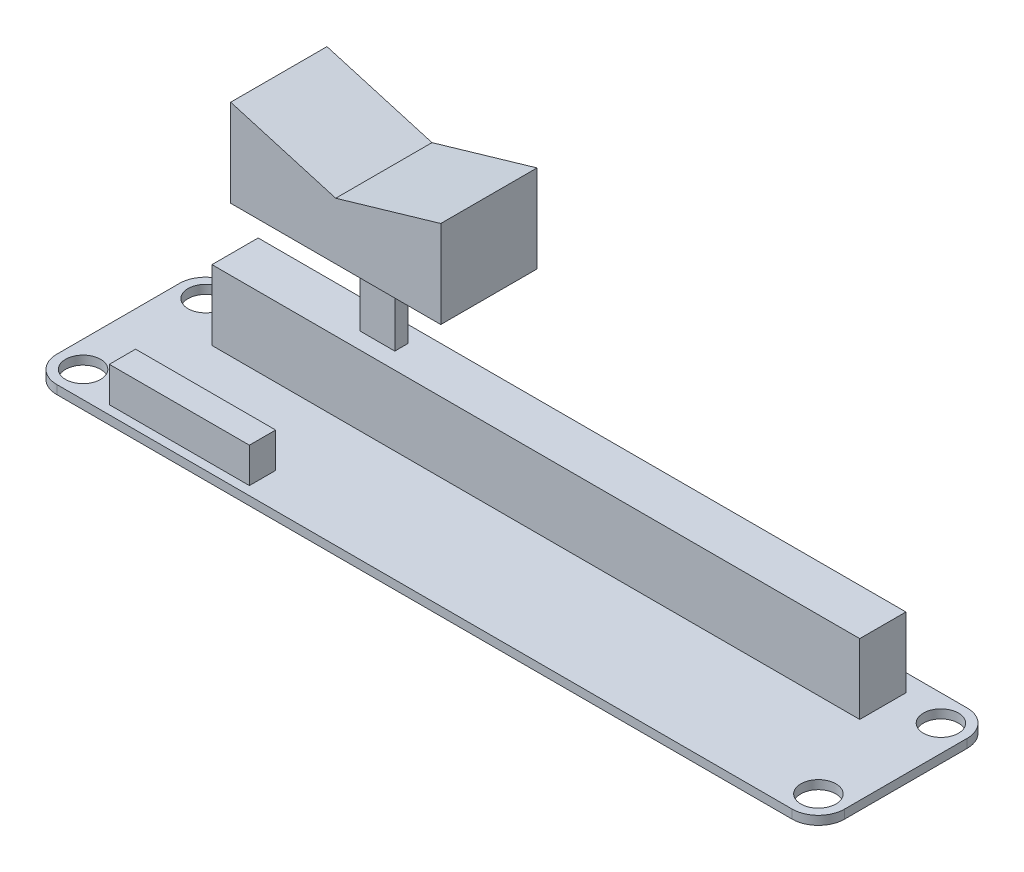
ISO-10303-21;
HEADER;
FILE_DESCRIPTION(('STEP AP214'),'2;1');
FILE_NAME('part.step','',(''),(''),'','','');
FILE_SCHEMA(('AUTOMOTIVE_DESIGN { 1 0 10303 214 1 1 1 1 }'));
ENDSEC;
DATA;
#1=APPLICATION_CONTEXT('core data for automotive mechanical design processes');
#2=APPLICATION_PROTOCOL_DEFINITION('international standard','automotive_design',2000,#1);
#3=PRODUCT_CONTEXT('',#1,'mechanical');
#4=PRODUCT('Part','Part','',(#3));
#5=PRODUCT_RELATED_PRODUCT_CATEGORY('part','',(#4));
#6=PRODUCT_DEFINITION_FORMATION('','',#4);
#7=PRODUCT_DEFINITION_CONTEXT('part definition',#1,'design');
#8=PRODUCT_DEFINITION('design','',#6,#7);
#9=PRODUCT_DEFINITION_SHAPE('','',#8);
#10=(LENGTH_UNIT() NAMED_UNIT(*) SI_UNIT(.MILLI.,.METRE.));
#11=(NAMED_UNIT(*) PLANE_ANGLE_UNIT() SI_UNIT($,.RADIAN.));
#12=(NAMED_UNIT(*) SI_UNIT($,.STERADIAN.) SOLID_ANGLE_UNIT());
#13=UNCERTAINTY_MEASURE_WITH_UNIT(LENGTH_MEASURE(1.E-05),#10,'distance_accuracy_value','');
#14=(GEOMETRIC_REPRESENTATION_CONTEXT(3) GLOBAL_UNCERTAINTY_ASSIGNED_CONTEXT((#13)) GLOBAL_UNIT_ASSIGNED_CONTEXT((#10,
#11,#12)) REPRESENTATION_CONTEXT('',''));
#15=CARTESIAN_POINT('',(0.,0.,0.));
#16=DIRECTION('',(0.,0.,1.));
#17=DIRECTION('',(1.,0.,0.));
#18=AXIS2_PLACEMENT_3D('',#15,#16,#17);
#19=CARTESIAN_POINT('',(0.,9.,0.));
#20=DIRECTION('',(0.,1.,0.));
#21=DIRECTION('',(0.,0.,1.));
#22=AXIS2_PLACEMENT_3D('',#19,#20,#21);
#23=PLANE('',#22);
#24=DIRECTION('',(0.,0.,1.));
#25=VECTOR('',#24,1.);
#26=CARTESIAN_POINT('',(8.,9.,-18.));
#27=LINE('',#26,#25);
#28=CARTESIAN_POINT('',(8.,9.,-18.));
#29=VERTEX_POINT('',#28);
#30=CARTESIAN_POINT('',(8.,9.,-12.7246609172367));
#31=VERTEX_POINT('',#30);
#32=EDGE_CURVE('E310',#29,#31,#27,.T.);
#33=ORIENTED_EDGE('',*,*,#32,.T.);
#34=DIRECTION('',(1.,0.,0.));
#35=VECTOR('',#34,1.);
#36=CARTESIAN_POINT('',(8.,9.,-12.7246609172367));
#37=LINE('',#36,#35);
#38=CARTESIAN_POINT('',(82.,9.,-12.7246609172367));
#39=VERTEX_POINT('',#38);
#40=EDGE_CURVE('E313',#31,#39,#37,.T.);
#41=ORIENTED_EDGE('',*,*,#40,.T.);
#42=DIRECTION('',(0.,0.,-1.));
#43=VECTOR('',#42,1.);
#44=CARTESIAN_POINT('',(82.,9.,-18.));
#45=LINE('',#44,#43);
#46=CARTESIAN_POINT('',(82.,9.,-18.));
#47=VERTEX_POINT('',#46);
#48=EDGE_CURVE('E316',#39,#47,#45,.T.);
#49=ORIENTED_EDGE('',*,*,#48,.T.);
#50=DIRECTION('',(-1.,0.,0.));
#51=VECTOR('',#50,1.);
#52=CARTESIAN_POINT('',(8.,9.,-18.));
#53=LINE('',#52,#51);
#54=EDGE_CURVE('E318',#47,#29,#53,.T.);
#55=ORIENTED_EDGE('',*,*,#54,.T.);
#56=EDGE_LOOP('',(#33,#41,#49,#55));
#57=FACE_BOUND('',#56,.T.);
#58=DIRECTION('',(1.,0.,0.));
#59=VECTOR('',#58,1.);
#60=CARTESIAN_POINT('',(23.,9.,-14.6123304586183));
#61=LINE('',#60,#59);
#62=CARTESIAN_POINT('',(23.,9.,-14.6123304586183));
#63=VERTEX_POINT('',#62);
#64=CARTESIAN_POINT('',(27.,9.,-14.6123304586183));
#65=VERTEX_POINT('',#64);
#66=EDGE_CURVE('E266',#63,#65,#61,.T.);
#67=ORIENTED_EDGE('',*,*,#66,.F.);
#68=DIRECTION('',(0.,0.,1.));
#69=VECTOR('',#68,1.);
#70=CARTESIAN_POINT('',(23.,9.,-16.1123304586183));
#71=LINE('',#70,#69);
#72=CARTESIAN_POINT('',(23.,9.,-16.1123304586183));
#73=VERTEX_POINT('',#72);
#74=EDGE_CURVE('E249',#73,#63,#71,.T.);
#75=ORIENTED_EDGE('',*,*,#74,.F.);
#76=DIRECTION('',(-1.,0.,0.));
#77=VECTOR('',#76,1.);
#78=CARTESIAN_POINT('',(23.,9.,-16.1123304586183));
#79=LINE('',#78,#77);
#80=CARTESIAN_POINT('',(27.,9.,-16.1123304586183));
#81=VERTEX_POINT('',#80);
#82=EDGE_CURVE('E254',#81,#73,#79,.T.);
#83=ORIENTED_EDGE('',*,*,#82,.F.);
#84=DIRECTION('',(0.,0.,-1.));
#85=VECTOR('',#84,1.);
#86=CARTESIAN_POINT('',(27.,9.,-16.1123304586183));
#87=LINE('',#86,#85);
#88=EDGE_CURVE('E268',#65,#81,#87,.T.);
#89=ORIENTED_EDGE('',*,*,#88,.F.);
#90=EDGE_LOOP('',(#67,#75,#83,#89));
#91=FACE_BOUND('',#90,.T.);
#92=ADVANCED_FACE('F34',(#57,#91),#23,.T.);
#93=CARTESIAN_POINT('',(0.,1.,0.));
#94=DIRECTION('',(0.,-1.,0.));
#95=DIRECTION('',(0.,0.,-1.));
#96=AXIS2_PLACEMENT_3D('',#93,#94,#95);
#97=PLANE('',#96);
#98=DIRECTION('',(0.,0.,1.));
#99=VECTOR('',#98,1.);
#100=CARTESIAN_POINT('',(8.,1.,-18.));
#101=LINE('',#100,#99);
#102=CARTESIAN_POINT('',(8.,1.,-18.));
#103=VERTEX_POINT('',#102);
#104=CARTESIAN_POINT('',(8.,1.,-12.7246609172367));
#105=VERTEX_POINT('',#104);
#106=EDGE_CURVE('E309',#103,#105,#101,.T.);
#107=ORIENTED_EDGE('',*,*,#106,.F.);
#108=DIRECTION('',(-1.,0.,0.));
#109=VECTOR('',#108,1.);
#110=CARTESIAN_POINT('',(8.,1.,-18.));
#111=LINE('',#110,#109);
#112=CARTESIAN_POINT('',(82.,1.,-18.));
#113=VERTEX_POINT('',#112);
#114=EDGE_CURVE('E314',#113,#103,#111,.T.);
#115=ORIENTED_EDGE('',*,*,#114,.F.);
#116=DIRECTION('',(0.,0.,-1.));
#117=VECTOR('',#116,1.);
#118=CARTESIAN_POINT('',(82.,1.,-18.));
#119=LINE('',#118,#117);
#120=CARTESIAN_POINT('',(82.,1.,-12.7246609172367));
#121=VERTEX_POINT('',#120);
#122=EDGE_CURVE('E326',#121,#113,#119,.T.);
#123=ORIENTED_EDGE('',*,*,#122,.F.);
#124=DIRECTION('',(1.,0.,0.));
#125=VECTOR('',#124,1.);
#126=CARTESIAN_POINT('',(8.,1.,-12.7246609172367));
#127=LINE('',#126,#125);
#128=EDGE_CURVE('E323',#105,#121,#127,.T.);
#129=ORIENTED_EDGE('',*,*,#128,.F.);
#130=EDGE_LOOP('',(#107,#115,#123,#129));
#131=FACE_BOUND('',#130,.T.);
#132=CARTESIAN_POINT('',(87.,1.,-16.9999999999999));
#133=DIRECTION('',(0.,1.,0.));
#134=DIRECTION('',(0.,0.,-1.));
#135=AXIS2_PLACEMENT_3D('',#132,#133,#134);
#136=CIRCLE('',#135,1.99999999999999);
#137=CARTESIAN_POINT('',(87.,1.,-18.9999999999999));
#138=VERTEX_POINT('',#137);
#139=EDGE_CURVE('E347',#138,#138,#136,.T.);
#140=ORIENTED_EDGE('',*,*,#139,.F.);
#141=EDGE_LOOP('',(#140));
#142=FACE_BOUND('',#141,.T.);
#143=CARTESIAN_POINT('',(87.,1.,-3.00000000000012));
#144=DIRECTION('',(0.,1.,0.));
#145=DIRECTION('',(0.,0.,1.));
#146=AXIS2_PLACEMENT_3D('',#143,#144,#145);
#147=CIRCLE('',#146,1.99999999999999);
#148=CARTESIAN_POINT('',(87.,1.,-1.00000000000013));
#149=VERTEX_POINT('',#148);
#150=EDGE_CURVE('E353',#149,#149,#147,.T.);
#151=ORIENTED_EDGE('',*,*,#150,.F.);
#152=EDGE_LOOP('',(#151));
#153=FACE_BOUND('',#152,.T.);
#154=CARTESIAN_POINT('',(3.,1.,-3.));
#155=DIRECTION('',(0.,1.,0.));
#156=DIRECTION('',(0.,0.,-1.));
#157=AXIS2_PLACEMENT_3D('',#154,#155,#156);
#158=CIRCLE('',#157,2.);
#159=CARTESIAN_POINT('',(3.,1.,-5.));
#160=VERTEX_POINT('',#159);
#161=EDGE_CURVE('E342',#160,#160,#158,.T.);
#162=ORIENTED_EDGE('',*,*,#161,.F.);
#163=EDGE_LOOP('',(#162));
#164=FACE_BOUND('',#163,.T.);
#165=CARTESIAN_POINT('',(3.,1.,-17.));
#166=DIRECTION('',(0.,1.,0.));
#167=DIRECTION('',(0.,0.,1.));
#168=AXIS2_PLACEMENT_3D('',#165,#166,#167);
#169=CIRCLE('',#168,2.);
#170=CARTESIAN_POINT('',(3.,1.,-15.));
#171=VERTEX_POINT('',#170);
#172=EDGE_CURVE('E346',#171,#171,#169,.T.);
#173=ORIENTED_EDGE('',*,*,#172,.F.);
#174=EDGE_LOOP('',(#173));
#175=FACE_BOUND('',#174,.T.);
#176=DIRECTION('',(0.,0.,-1.));
#177=VECTOR('',#176,1.);
#178=CARTESIAN_POINT('',(90.,1.,0.));
#179=LINE('',#178,#177);
#180=CARTESIAN_POINT('',(90.,1.,-3.));
#181=VERTEX_POINT('',#180);
#182=CARTESIAN_POINT('',(90.,1.,-17.));
#183=VERTEX_POINT('',#182);
#184=EDGE_CURVE('E374',#181,#183,#179,.T.);
#185=ORIENTED_EDGE('',*,*,#184,.T.);
#186=CARTESIAN_POINT('',(87.,1.,-17.));
#187=DIRECTION('',(0.,-1.,0.));
#188=DIRECTION('',(0.,0.,-1.));
#189=AXIS2_PLACEMENT_3D('',#186,#187,#188);
#190=CIRCLE('',#189,3.);
#191=CARTESIAN_POINT('',(87.,1.,-20.));
#192=VERTEX_POINT('',#191);
#193=EDGE_CURVE('E414',#183,#192,#190,.F.);
#194=ORIENTED_EDGE('',*,*,#193,.T.);
#195=DIRECTION('',(-1.,0.,0.));
#196=VECTOR('',#195,1.);
#197=CARTESIAN_POINT('',(0.,1.,-20.));
#198=LINE('',#197,#196);
#199=CARTESIAN_POINT('',(3.,1.,-20.));
#200=VERTEX_POINT('',#199);
#201=EDGE_CURVE('E377',#192,#200,#198,.T.);
#202=ORIENTED_EDGE('',*,*,#201,.T.);
#203=CARTESIAN_POINT('',(3.,1.,-17.));
#204=DIRECTION('',(0.,-1.,0.));
#205=DIRECTION('',(0.,0.,-1.));
#206=AXIS2_PLACEMENT_3D('',#203,#204,#205);
#207=CIRCLE('',#206,3.);
#208=CARTESIAN_POINT('',(0.,1.,-17.));
#209=VERTEX_POINT('',#208);
#210=EDGE_CURVE('E408',#200,#209,#207,.F.);
#211=ORIENTED_EDGE('',*,*,#210,.T.);
#212=DIRECTION('',(0.,0.,1.));
#213=VECTOR('',#212,1.);
#214=CARTESIAN_POINT('',(0.,1.,0.));
#215=LINE('',#214,#213);
#216=CARTESIAN_POINT('',(0.,1.,-3.));
#217=VERTEX_POINT('',#216);
#218=EDGE_CURVE('E367',#209,#217,#215,.T.);
#219=ORIENTED_EDGE('',*,*,#218,.T.);
#220=CARTESIAN_POINT('',(3.,1.,-3.));
#221=DIRECTION('',(0.,-1.,0.));
#222=DIRECTION('',(0.,0.,-1.));
#223=AXIS2_PLACEMENT_3D('',#220,#221,#222);
#224=CIRCLE('',#223,3.);
#225=CARTESIAN_POINT('',(3.,1.,0.));
#226=VERTEX_POINT('',#225);
#227=EDGE_CURVE('E410',#217,#226,#224,.F.);
#228=ORIENTED_EDGE('',*,*,#227,.T.);
#229=DIRECTION('',(1.,0.,0.));
#230=VECTOR('',#229,1.);
#231=CARTESIAN_POINT('',(0.,1.,0.));
#232=LINE('',#231,#230);
#233=CARTESIAN_POINT('',(87.,1.,0.));
#234=VERTEX_POINT('',#233);
#235=EDGE_CURVE('E370',#226,#234,#232,.T.);
#236=ORIENTED_EDGE('',*,*,#235,.T.);
#237=CARTESIAN_POINT('',(87.,1.,-3.));
#238=DIRECTION('',(0.,-1.,0.));
#239=DIRECTION('',(0.,0.,-1.));
#240=AXIS2_PLACEMENT_3D('',#237,#238,#239);
#241=CIRCLE('',#240,3.);
#242=EDGE_CURVE('E412',#234,#181,#241,.F.);
#243=ORIENTED_EDGE('',*,*,#242,.T.);
#244=EDGE_LOOP('',(#185,#194,#202,#211,#219,#228,#236,#243));
#245=FACE_BOUND('',#244,.T.);
#246=DIRECTION('',(0.,0.,1.));
#247=VECTOR('',#246,1.);
#248=CARTESIAN_POINT('',(8.,1.,-4.));
#249=LINE('',#248,#247);
#250=CARTESIAN_POINT('',(8.,1.,-4.));
#251=VERTEX_POINT('',#250);
#252=CARTESIAN_POINT('',(8.,1.,-1.));
#253=VERTEX_POINT('',#252);
#254=EDGE_CURVE('E279',#251,#253,#249,.T.);
#255=ORIENTED_EDGE('',*,*,#254,.F.);
#256=DIRECTION('',(-1.,0.,0.));
#257=VECTOR('',#256,1.);
#258=CARTESIAN_POINT('',(8.,1.,-4.));
#259=LINE('',#258,#257);
#260=CARTESIAN_POINT('',(24.,1.,-4.));
#261=VERTEX_POINT('',#260);
#262=EDGE_CURVE('E284',#261,#251,#259,.T.);
#263=ORIENTED_EDGE('',*,*,#262,.F.);
#264=DIRECTION('',(0.,0.,-1.));
#265=VECTOR('',#264,1.);
#266=CARTESIAN_POINT('',(24.,1.,-4.));
#267=LINE('',#266,#265);
#268=CARTESIAN_POINT('',(24.,1.,-1.));
#269=VERTEX_POINT('',#268);
#270=EDGE_CURVE('E294',#269,#261,#267,.T.);
#271=ORIENTED_EDGE('',*,*,#270,.F.);
#272=DIRECTION('',(1.,0.,0.));
#273=VECTOR('',#272,1.);
#274=CARTESIAN_POINT('',(8.,1.,-1.));
#275=LINE('',#274,#273);
#276=EDGE_CURVE('E57',#253,#269,#275,.T.);
#277=ORIENTED_EDGE('',*,*,#276,.F.);
#278=EDGE_LOOP('',(#255,#263,#271,#277));
#279=FACE_BOUND('',#278,.T.);
#280=ADVANCED_FACE('F443',(#131,#142,#153,#164,#175,#245,#279),#97,.F.);
#281=CARTESIAN_POINT('',(0.,1.,0.));
#282=DIRECTION('',(1.,0.,0.));
#283=DIRECTION('',(0.,0.,-1.));
#284=AXIS2_PLACEMENT_3D('',#281,#282,#283);
#285=PLANE('',#284);
#286=DIRECTION('',(0.,0.,1.));
#287=VECTOR('',#286,1.);
#288=CARTESIAN_POINT('',(0.,0.,0.));
#289=LINE('',#288,#287);
#290=CARTESIAN_POINT('',(0.,0.,-17.));
#291=VERTEX_POINT('',#290);
#292=CARTESIAN_POINT('',(0.,0.,-3.));
#293=VERTEX_POINT('',#292);
#294=EDGE_CURVE('E364',#291,#293,#289,.T.);
#295=ORIENTED_EDGE('',*,*,#294,.T.);
#296=DIRECTION('',(0.,-1.,0.));
#297=VECTOR('',#296,1.);
#298=CARTESIAN_POINT('',(0.,1.,-3.));
#299=LINE('',#298,#297);
#300=EDGE_CURVE('E11',#293,#217,#299,.F.);
#301=ORIENTED_EDGE('',*,*,#300,.T.);
#302=ORIENTED_EDGE('',*,*,#218,.F.);
#303=DIRECTION('',(0.,-1.,0.));
#304=VECTOR('',#303,1.);
#305=CARTESIAN_POINT('',(0.,1.,-17.));
#306=LINE('',#305,#304);
#307=EDGE_CURVE('E42',#209,#291,#306,.T.);
#308=ORIENTED_EDGE('',*,*,#307,.T.);
#309=EDGE_LOOP('',(#295,#301,#302,#308));
#310=FACE_BOUND('',#309,.T.);
#311=ADVANCED_FACE('F425',(#310),#285,.F.);
#312=CARTESIAN_POINT('',(0.,1.,0.));
#313=DIRECTION('',(0.,0.,-1.));
#314=DIRECTION('',(-1.,0.,0.));
#315=AXIS2_PLACEMENT_3D('',#312,#313,#314);
#316=PLANE('',#315);
#317=DIRECTION('',(1.,0.,0.));
#318=VECTOR('',#317,1.);
#319=CARTESIAN_POINT('',(0.,0.,0.));
#320=LINE('',#319,#318);
#321=CARTESIAN_POINT('',(3.,0.,0.));
#322=VERTEX_POINT('',#321);
#323=CARTESIAN_POINT('',(87.,0.,0.));
#324=VERTEX_POINT('',#323);
#325=EDGE_CURVE('E383',#322,#324,#320,.T.);
#326=ORIENTED_EDGE('',*,*,#325,.T.);
#327=DIRECTION('',(0.,-1.,0.));
#328=VECTOR('',#327,1.);
#329=CARTESIAN_POINT('',(87.,1.,0.));
#330=LINE('',#329,#328);
#331=EDGE_CURVE('E419',#324,#234,#330,.F.);
#332=ORIENTED_EDGE('',*,*,#331,.T.);
#333=ORIENTED_EDGE('',*,*,#235,.F.);
#334=DIRECTION('',(0.,-1.,0.));
#335=VECTOR('',#334,1.);
#336=CARTESIAN_POINT('',(3.,1.,0.));
#337=LINE('',#336,#335);
#338=EDGE_CURVE('E416',#226,#322,#337,.T.);
#339=ORIENTED_EDGE('',*,*,#338,.T.);
#340=EDGE_LOOP('',(#326,#332,#333,#339));
#341=FACE_BOUND('',#340,.T.);
#342=ADVANCED_FACE('F439',(#341),#316,.F.);
#343=CARTESIAN_POINT('',(90.,1.,0.));
#344=DIRECTION('',(-1.,0.,0.));
#345=DIRECTION('',(0.,0.,1.));
#346=AXIS2_PLACEMENT_3D('',#343,#344,#345);
#347=PLANE('',#346);
#348=DIRECTION('',(0.,0.,-1.));
#349=VECTOR('',#348,1.);
#350=CARTESIAN_POINT('',(90.,0.,0.));
#351=LINE('',#350,#349);
#352=CARTESIAN_POINT('',(90.,0.,-3.));
#353=VERTEX_POINT('',#352);
#354=CARTESIAN_POINT('',(90.,0.,-17.));
#355=VERTEX_POINT('',#354);
#356=EDGE_CURVE('E386',#353,#355,#351,.T.);
#357=ORIENTED_EDGE('',*,*,#356,.T.);
#358=DIRECTION('',(0.,-1.,0.));
#359=VECTOR('',#358,1.);
#360=CARTESIAN_POINT('',(90.,1.,-17.));
#361=LINE('',#360,#359);
#362=EDGE_CURVE('E406',#355,#183,#361,.F.);
#363=ORIENTED_EDGE('',*,*,#362,.T.);
#364=ORIENTED_EDGE('',*,*,#184,.F.);
#365=DIRECTION('',(0.,-1.,0.));
#366=VECTOR('',#365,1.);
#367=CARTESIAN_POINT('',(90.,1.,-3.));
#368=LINE('',#367,#366);
#369=EDGE_CURVE('E403',#181,#353,#368,.T.);
#370=ORIENTED_EDGE('',*,*,#369,.T.);
#371=EDGE_LOOP('',(#357,#363,#364,#370));
#372=FACE_BOUND('',#371,.T.);
#373=ADVANCED_FACE('F450',(#372),#347,.F.);
#374=CARTESIAN_POINT('',(0.,1.,-20.));
#375=DIRECTION('',(0.,0.,1.));
#376=DIRECTION('',(1.,0.,0.));
#377=AXIS2_PLACEMENT_3D('',#374,#375,#376);
#378=PLANE('',#377);
#379=ORIENTED_EDGE('',*,*,#201,.F.);
#380=DIRECTION('',(0.,-1.,0.));
#381=VECTOR('',#380,1.);
#382=CARTESIAN_POINT('',(87.,1.,-20.));
#383=LINE('',#382,#381);
#384=CARTESIAN_POINT('',(87.,0.,-20.));
#385=VERTEX_POINT('',#384);
#386=EDGE_CURVE('E392',#192,#385,#383,.T.);
#387=ORIENTED_EDGE('',*,*,#386,.T.);
#388=DIRECTION('',(-1.,0.,0.));
#389=VECTOR('',#388,1.);
#390=CARTESIAN_POINT('',(0.,0.,-20.));
#391=LINE('',#390,#389);
#392=CARTESIAN_POINT('',(3.,0.,-20.));
#393=VERTEX_POINT('',#392);
#394=EDGE_CURVE('E371',#385,#393,#391,.T.);
#395=ORIENTED_EDGE('',*,*,#394,.T.);
#396=DIRECTION('',(0.,-1.,0.));
#397=VECTOR('',#396,1.);
#398=CARTESIAN_POINT('',(3.,1.,-20.));
#399=LINE('',#398,#397);
#400=EDGE_CURVE('E380',#393,#200,#399,.F.);
#401=ORIENTED_EDGE('',*,*,#400,.T.);
#402=EDGE_LOOP('',(#379,#387,#395,#401));
#403=FACE_BOUND('',#402,.T.);
#404=ADVANCED_FACE('F458',(#403),#378,.F.);
#405=CARTESIAN_POINT('',(0.,0.,0.));
#406=DIRECTION('',(0.,-1.,0.));
#407=DIRECTION('',(0.,0.,-1.));
#408=AXIS2_PLACEMENT_3D('',#405,#406,#407);
#409=PLANE('',#408);
#410=CARTESIAN_POINT('',(87.,0.,-16.9999999999999));
#411=DIRECTION('',(0.,1.,0.));
#412=DIRECTION('',(0.,0.,-1.));
#413=AXIS2_PLACEMENT_3D('',#410,#411,#412);
#414=CIRCLE('',#413,1.99999999999999);
#415=CARTESIAN_POINT('',(87.,0.,-18.9999999999999));
#416=VERTEX_POINT('',#415);
#417=EDGE_CURVE('E343',#416,#416,#414,.T.);
#418=ORIENTED_EDGE('',*,*,#417,.T.);
#419=EDGE_LOOP('',(#418));
#420=FACE_BOUND('',#419,.T.);
#421=CARTESIAN_POINT('',(87.,0.,-3.00000000000012));
#422=DIRECTION('',(0.,1.,0.));
#423=DIRECTION('',(0.,0.,1.));
#424=AXIS2_PLACEMENT_3D('',#421,#422,#423);
#425=CIRCLE('',#424,1.99999999999999);
#426=CARTESIAN_POINT('',(87.,0.,-1.00000000000013));
#427=VERTEX_POINT('',#426);
#428=EDGE_CURVE('E350',#427,#427,#425,.T.);
#429=ORIENTED_EDGE('',*,*,#428,.T.);
#430=EDGE_LOOP('',(#429));
#431=FACE_BOUND('',#430,.T.);
#432=CARTESIAN_POINT('',(3.,0.,-3.));
#433=DIRECTION('',(0.,1.,0.));
#434=DIRECTION('',(0.,0.,-1.));
#435=AXIS2_PLACEMENT_3D('',#432,#433,#434);
#436=CIRCLE('',#435,2.);
#437=CARTESIAN_POINT('',(3.,0.,-5.));
#438=VERTEX_POINT('',#437);
#439=EDGE_CURVE('E356',#438,#438,#436,.T.);
#440=ORIENTED_EDGE('',*,*,#439,.T.);
#441=EDGE_LOOP('',(#440));
#442=FACE_BOUND('',#441,.T.);
#443=CARTESIAN_POINT('',(3.,0.,-17.));
#444=DIRECTION('',(0.,1.,0.));
#445=DIRECTION('',(0.,0.,1.));
#446=AXIS2_PLACEMENT_3D('',#443,#444,#445);
#447=CIRCLE('',#446,2.);
#448=CARTESIAN_POINT('',(3.,0.,-15.));
#449=VERTEX_POINT('',#448);
#450=EDGE_CURVE('E361',#449,#449,#447,.T.);
#451=ORIENTED_EDGE('',*,*,#450,.T.);
#452=EDGE_LOOP('',(#451));
#453=FACE_BOUND('',#452,.T.);
#454=ORIENTED_EDGE('',*,*,#394,.F.);
#455=CARTESIAN_POINT('',(87.,0.,-17.));
#456=DIRECTION('',(0.,-1.,0.));
#457=DIRECTION('',(0.,0.,-1.));
#458=AXIS2_PLACEMENT_3D('',#455,#456,#457);
#459=CIRCLE('',#458,3.);
#460=EDGE_CURVE('E401',#385,#355,#459,.T.);
#461=ORIENTED_EDGE('',*,*,#460,.T.);
#462=ORIENTED_EDGE('',*,*,#356,.F.);
#463=CARTESIAN_POINT('',(87.,0.,-3.));
#464=DIRECTION('',(0.,-1.,0.));
#465=DIRECTION('',(0.,0.,-1.));
#466=AXIS2_PLACEMENT_3D('',#463,#464,#465);
#467=CIRCLE('',#466,3.);
#468=EDGE_CURVE('E399',#353,#324,#467,.T.);
#469=ORIENTED_EDGE('',*,*,#468,.T.);
#470=ORIENTED_EDGE('',*,*,#325,.F.);
#471=CARTESIAN_POINT('',(3.,0.,-3.));
#472=DIRECTION('',(0.,-1.,0.));
#473=DIRECTION('',(0.,0.,-1.));
#474=AXIS2_PLACEMENT_3D('',#471,#472,#473);
#475=CIRCLE('',#474,3.);
#476=EDGE_CURVE('E397',#322,#293,#475,.T.);
#477=ORIENTED_EDGE('',*,*,#476,.T.);
#478=ORIENTED_EDGE('',*,*,#294,.F.);
#479=CARTESIAN_POINT('',(3.,0.,-17.));
#480=DIRECTION('',(0.,-1.,0.));
#481=DIRECTION('',(0.,0.,-1.));
#482=AXIS2_PLACEMENT_3D('',#479,#480,#481);
#483=CIRCLE('',#482,3.);
#484=EDGE_CURVE('E395',#291,#393,#483,.T.);
#485=ORIENTED_EDGE('',*,*,#484,.T.);
#486=EDGE_LOOP('',(#454,#461,#462,#469,#470,#477,#478,#485));
#487=FACE_BOUND('',#486,.T.);
#488=ADVANCED_FACE('F431',(#420,#431,#442,#453,#487),#409,.T.);
#489=CARTESIAN_POINT('',(3.,0.,-17.));
#490=DIRECTION('',(0.,1.,0.));
#491=DIRECTION('',(0.,0.,1.));
#492=AXIS2_PLACEMENT_3D('',#489,#490,#491);
#493=CYLINDRICAL_SURFACE('',#492,2.);
#494=ORIENTED_EDGE('',*,*,#450,.F.);
#495=EDGE_LOOP('',(#494));
#496=FACE_BOUND('',#495,.T.);
#497=ORIENTED_EDGE('',*,*,#172,.T.);
#498=EDGE_LOOP('',(#497));
#499=FACE_BOUND('',#498,.T.);
#500=ADVANCED_FACE('F504',(#496,#499),#493,.F.);
#501=CARTESIAN_POINT('',(3.,0.,-3.));
#502=DIRECTION('',(0.,1.,0.));
#503=DIRECTION('',(0.,0.,1.));
#504=AXIS2_PLACEMENT_3D('',#501,#502,#503);
#505=CYLINDRICAL_SURFACE('',#504,2.);
#506=ORIENTED_EDGE('',*,*,#439,.F.);
#507=EDGE_LOOP('',(#506));
#508=FACE_BOUND('',#507,.T.);
#509=ORIENTED_EDGE('',*,*,#161,.T.);
#510=EDGE_LOOP('',(#509));
#511=FACE_BOUND('',#510,.T.);
#512=ADVANCED_FACE('F500',(#508,#511),#505,.F.);
#513=CARTESIAN_POINT('',(87.,0.,-3.00000000000012));
#514=DIRECTION('',(0.,1.,0.));
#515=DIRECTION('',(0.,0.,1.));
#516=AXIS2_PLACEMENT_3D('',#513,#514,#515);
#517=CYLINDRICAL_SURFACE('',#516,1.99999999999999);
#518=ORIENTED_EDGE('',*,*,#428,.F.);
#519=EDGE_LOOP('',(#518));
#520=FACE_BOUND('',#519,.T.);
#521=ORIENTED_EDGE('',*,*,#150,.T.);
#522=EDGE_LOOP('',(#521));
#523=FACE_BOUND('',#522,.T.);
#524=ADVANCED_FACE('F496',(#520,#523),#517,.F.);
#525=CARTESIAN_POINT('',(87.,0.,-16.9999999999999));
#526=DIRECTION('',(0.,1.,0.));
#527=DIRECTION('',(0.,0.,1.));
#528=AXIS2_PLACEMENT_3D('',#525,#526,#527);
#529=CYLINDRICAL_SURFACE('',#528,1.99999999999999);
#530=ORIENTED_EDGE('',*,*,#417,.F.);
#531=EDGE_LOOP('',(#530));
#532=FACE_BOUND('',#531,.T.);
#533=ORIENTED_EDGE('',*,*,#139,.T.);
#534=EDGE_LOOP('',(#533));
#535=FACE_BOUND('',#534,.T.);
#536=ADVANCED_FACE('F493',(#532,#535),#529,.F.);
#537=CARTESIAN_POINT('',(87.,1.,-17.));
#538=DIRECTION('',(0.,-1.,0.));
#539=DIRECTION('',(0.,0.,-1.));
#540=AXIS2_PLACEMENT_3D('',#537,#538,#539);
#541=CYLINDRICAL_SURFACE('',#540,3.);
#542=ORIENTED_EDGE('',*,*,#193,.F.);
#543=ORIENTED_EDGE('',*,*,#362,.F.);
#544=ORIENTED_EDGE('',*,*,#460,.F.);
#545=ORIENTED_EDGE('',*,*,#386,.F.);
#546=EDGE_LOOP('',(#542,#543,#544,#545));
#547=FACE_BOUND('',#546,.T.);
#548=ADVANCED_FACE('F455',(#547),#541,.T.);
#549=CARTESIAN_POINT('',(87.,1.,-3.));
#550=DIRECTION('',(0.,-1.,0.));
#551=DIRECTION('',(0.,0.,-1.));
#552=AXIS2_PLACEMENT_3D('',#549,#550,#551);
#553=CYLINDRICAL_SURFACE('',#552,3.);
#554=ORIENTED_EDGE('',*,*,#242,.F.);
#555=ORIENTED_EDGE('',*,*,#331,.F.);
#556=ORIENTED_EDGE('',*,*,#468,.F.);
#557=ORIENTED_EDGE('',*,*,#369,.F.);
#558=EDGE_LOOP('',(#554,#555,#556,#557));
#559=FACE_BOUND('',#558,.T.);
#560=ADVANCED_FACE('F447',(#559),#553,.T.);
#561=CARTESIAN_POINT('',(3.,1.,-3.));
#562=DIRECTION('',(0.,-1.,0.));
#563=DIRECTION('',(0.,0.,-1.));
#564=AXIS2_PLACEMENT_3D('',#561,#562,#563);
#565=CYLINDRICAL_SURFACE('',#564,3.);
#566=ORIENTED_EDGE('',*,*,#227,.F.);
#567=ORIENTED_EDGE('',*,*,#300,.F.);
#568=ORIENTED_EDGE('',*,*,#476,.F.);
#569=ORIENTED_EDGE('',*,*,#338,.F.);
#570=EDGE_LOOP('',(#566,#567,#568,#569));
#571=FACE_BOUND('',#570,.T.);
#572=ADVANCED_FACE('F436',(#571),#565,.T.);
#573=CARTESIAN_POINT('',(3.,1.,-17.));
#574=DIRECTION('',(0.,-1.,0.));
#575=DIRECTION('',(0.,0.,-1.));
#576=AXIS2_PLACEMENT_3D('',#573,#574,#575);
#577=CYLINDRICAL_SURFACE('',#576,3.);
#578=ORIENTED_EDGE('',*,*,#210,.F.);
#579=ORIENTED_EDGE('',*,*,#400,.F.);
#580=ORIENTED_EDGE('',*,*,#484,.F.);
#581=ORIENTED_EDGE('',*,*,#307,.F.);
#582=EDGE_LOOP('',(#578,#579,#580,#581));
#583=FACE_BOUND('',#582,.T.);
#584=ADVANCED_FACE('F36',(#583),#577,.T.);
#585=CARTESIAN_POINT('',(8.,9.,-18.));
#586=DIRECTION('',(1.,0.,0.));
#587=DIRECTION('',(0.,0.,-1.));
#588=AXIS2_PLACEMENT_3D('',#585,#586,#587);
#589=PLANE('',#588);
#590=ORIENTED_EDGE('',*,*,#106,.T.);
#591=DIRECTION('',(0.,-1.,0.));
#592=VECTOR('',#591,1.);
#593=CARTESIAN_POINT('',(8.,9.,-12.7246609172367));
#594=LINE('',#593,#592);
#595=EDGE_CURVE('E339',#31,#105,#594,.T.);
#596=ORIENTED_EDGE('',*,*,#595,.F.);
#597=ORIENTED_EDGE('',*,*,#32,.F.);
#598=DIRECTION('',(0.,-1.,0.));
#599=VECTOR('',#598,1.);
#600=CARTESIAN_POINT('',(8.,9.,-18.));
#601=LINE('',#600,#599);
#602=EDGE_CURVE('E320',#29,#103,#601,.T.);
#603=ORIENTED_EDGE('',*,*,#602,.T.);
#604=EDGE_LOOP('',(#590,#596,#597,#603));
#605=FACE_BOUND('',#604,.T.);
#606=ADVANCED_FACE('F461',(#605),#589,.F.);
#607=CARTESIAN_POINT('',(8.,9.,-12.7246609172367));
#608=DIRECTION('',(0.,0.,-1.));
#609=DIRECTION('',(-1.,0.,0.));
#610=AXIS2_PLACEMENT_3D('',#607,#608,#609);
#611=PLANE('',#610);
#612=ORIENTED_EDGE('',*,*,#128,.T.);
#613=DIRECTION('',(0.,-1.,0.));
#614=VECTOR('',#613,1.);
#615=CARTESIAN_POINT('',(82.,9.,-12.7246609172367));
#616=LINE('',#615,#614);
#617=EDGE_CURVE('E336',#39,#121,#616,.T.);
#618=ORIENTED_EDGE('',*,*,#617,.F.);
#619=ORIENTED_EDGE('',*,*,#40,.F.);
#620=ORIENTED_EDGE('',*,*,#595,.T.);
#621=EDGE_LOOP('',(#612,#618,#619,#620));
#622=FACE_BOUND('',#621,.T.);
#623=ADVANCED_FACE('F466',(#622),#611,.F.);
#624=CARTESIAN_POINT('',(82.,9.,-18.));
#625=DIRECTION('',(-1.,0.,0.));
#626=DIRECTION('',(0.,0.,1.));
#627=AXIS2_PLACEMENT_3D('',#624,#625,#626);
#628=PLANE('',#627);
#629=ORIENTED_EDGE('',*,*,#122,.T.);
#630=DIRECTION('',(0.,-1.,0.));
#631=VECTOR('',#630,1.);
#632=CARTESIAN_POINT('',(82.,9.,-18.));
#633=LINE('',#632,#631);
#634=EDGE_CURVE('E333',#47,#113,#633,.T.);
#635=ORIENTED_EDGE('',*,*,#634,.F.);
#636=ORIENTED_EDGE('',*,*,#48,.F.);
#637=ORIENTED_EDGE('',*,*,#617,.T.);
#638=EDGE_LOOP('',(#629,#635,#636,#637));
#639=FACE_BOUND('',#638,.T.);
#640=ADVANCED_FACE('F485',(#639),#628,.F.);
#641=CARTESIAN_POINT('',(8.,9.,-18.));
#642=DIRECTION('',(0.,0.,1.));
#643=DIRECTION('',(1.,0.,0.));
#644=AXIS2_PLACEMENT_3D('',#641,#642,#643);
#645=PLANE('',#644);
#646=ORIENTED_EDGE('',*,*,#114,.T.);
#647=ORIENTED_EDGE('',*,*,#602,.F.);
#648=ORIENTED_EDGE('',*,*,#54,.F.);
#649=ORIENTED_EDGE('',*,*,#634,.T.);
#650=EDGE_LOOP('',(#646,#647,#648,#649));
#651=FACE_BOUND('',#650,.T.);
#652=ADVANCED_FACE('F482',(#651),#645,.F.);
#653=CARTESIAN_POINT('',(8.,5.,-4.));
#654=DIRECTION('',(1.,0.,0.));
#655=DIRECTION('',(0.,0.,-1.));
#656=AXIS2_PLACEMENT_3D('',#653,#654,#655);
#657=PLANE('',#656);
#658=ORIENTED_EDGE('',*,*,#254,.T.);
#659=DIRECTION('',(0.,-1.,0.));
#660=VECTOR('',#659,1.);
#661=CARTESIAN_POINT('',(8.,5.,-1.));
#662=LINE('',#661,#660);
#663=CARTESIAN_POINT('',(8.,5.,-1.));
#664=VERTEX_POINT('',#663);
#665=EDGE_CURVE('E307',#664,#253,#662,.T.);
#666=ORIENTED_EDGE('',*,*,#665,.F.);
#667=DIRECTION('',(0.,0.,1.));
#668=VECTOR('',#667,1.);
#669=CARTESIAN_POINT('',(8.,5.,-4.));
#670=LINE('',#669,#668);
#671=CARTESIAN_POINT('',(8.,5.,-4.));
#672=VERTEX_POINT('',#671);
#673=EDGE_CURVE('E280',#672,#664,#670,.T.);
#674=ORIENTED_EDGE('',*,*,#673,.F.);
#675=DIRECTION('',(0.,-1.,0.));
#676=VECTOR('',#675,1.);
#677=CARTESIAN_POINT('',(8.,5.,-4.));
#678=LINE('',#677,#676);
#679=EDGE_CURVE('E290',#672,#251,#678,.T.);
#680=ORIENTED_EDGE('',*,*,#679,.T.);
#681=EDGE_LOOP('',(#658,#666,#674,#680));
#682=FACE_BOUND('',#681,.T.);
#683=ADVANCED_FACE('F480',(#682),#657,.F.);
#684=CARTESIAN_POINT('',(8.,5.,-1.));
#685=DIRECTION('',(0.,0.,-1.));
#686=DIRECTION('',(-1.,0.,0.));
#687=AXIS2_PLACEMENT_3D('',#684,#685,#686);
#688=PLANE('',#687);
#689=ORIENTED_EDGE('',*,*,#276,.T.);
#690=DIRECTION('',(0.,-1.,0.));
#691=VECTOR('',#690,1.);
#692=CARTESIAN_POINT('',(24.,5.,-1.));
#693=LINE('',#692,#691);
#694=CARTESIAN_POINT('',(24.,5.,-1.));
#695=VERTEX_POINT('',#694);
#696=EDGE_CURVE('E304',#695,#269,#693,.T.);
#697=ORIENTED_EDGE('',*,*,#696,.F.);
#698=DIRECTION('',(1.,0.,0.));
#699=VECTOR('',#698,1.);
#700=CARTESIAN_POINT('',(8.,5.,-1.));
#701=LINE('',#700,#699);
#702=EDGE_CURVE('E283',#664,#695,#701,.T.);
#703=ORIENTED_EDGE('',*,*,#702,.F.);
#704=ORIENTED_EDGE('',*,*,#665,.T.);
#705=EDGE_LOOP('',(#689,#697,#703,#704));
#706=FACE_BOUND('',#705,.T.);
#707=ADVANCED_FACE('F574',(#706),#688,.F.);
#708=CARTESIAN_POINT('',(24.,5.,-4.));
#709=DIRECTION('',(-1.,0.,0.));
#710=DIRECTION('',(0.,0.,1.));
#711=AXIS2_PLACEMENT_3D('',#708,#709,#710);
#712=PLANE('',#711);
#713=ORIENTED_EDGE('',*,*,#270,.T.);
#714=DIRECTION('',(0.,-1.,0.));
#715=VECTOR('',#714,1.);
#716=CARTESIAN_POINT('',(24.,5.,-4.));
#717=LINE('',#716,#715);
#718=CARTESIAN_POINT('',(24.,5.,-4.));
#719=VERTEX_POINT('',#718);
#720=EDGE_CURVE('E301',#719,#261,#717,.T.);
#721=ORIENTED_EDGE('',*,*,#720,.F.);
#722=DIRECTION('',(0.,0.,-1.));
#723=VECTOR('',#722,1.);
#724=CARTESIAN_POINT('',(24.,5.,-4.));
#725=LINE('',#724,#723);
#726=EDGE_CURVE('E286',#695,#719,#725,.T.);
#727=ORIENTED_EDGE('',*,*,#726,.F.);
#728=ORIENTED_EDGE('',*,*,#696,.T.);
#729=EDGE_LOOP('',(#713,#721,#727,#728));
#730=FACE_BOUND('',#729,.T.);
#731=ADVANCED_FACE('F583',(#730),#712,.F.);
#732=CARTESIAN_POINT('',(8.,5.,-4.));
#733=DIRECTION('',(0.,0.,1.));
#734=DIRECTION('',(1.,0.,0.));
#735=AXIS2_PLACEMENT_3D('',#732,#733,#734);
#736=PLANE('',#735);
#737=ORIENTED_EDGE('',*,*,#262,.T.);
#738=ORIENTED_EDGE('',*,*,#679,.F.);
#739=DIRECTION('',(-1.,0.,0.));
#740=VECTOR('',#739,1.);
#741=CARTESIAN_POINT('',(8.,5.,-4.));
#742=LINE('',#741,#740);
#743=EDGE_CURVE('E288',#719,#672,#742,.T.);
#744=ORIENTED_EDGE('',*,*,#743,.F.);
#745=ORIENTED_EDGE('',*,*,#720,.T.);
#746=EDGE_LOOP('',(#737,#738,#744,#745));
#747=FACE_BOUND('',#746,.T.);
#748=ADVANCED_FACE('F592',(#747),#736,.F.);
#749=CARTESIAN_POINT('',(0.,5.,0.));
#750=DIRECTION('',(0.,1.,0.));
#751=DIRECTION('',(0.,0.,1.));
#752=AXIS2_PLACEMENT_3D('',#749,#750,#751);
#753=PLANE('',#752);
#754=ORIENTED_EDGE('',*,*,#673,.T.);
#755=ORIENTED_EDGE('',*,*,#702,.T.);
#756=ORIENTED_EDGE('',*,*,#726,.T.);
#757=ORIENTED_EDGE('',*,*,#743,.T.);
#758=EDGE_LOOP('',(#754,#755,#756,#757));
#759=FACE_BOUND('',#758,.T.);
#760=ADVANCED_FACE('F602',(#759),#753,.T.);
#761=CARTESIAN_POINT('',(23.,19.,-16.1123304586183));
#762=DIRECTION('',(1.,0.,0.));
#763=DIRECTION('',(0.,0.,-1.));
#764=AXIS2_PLACEMENT_3D('',#761,#762,#763);
#765=PLANE('',#764);
#766=ORIENTED_EDGE('',*,*,#74,.T.);
#767=DIRECTION('',(0.,-1.,0.));
#768=VECTOR('',#767,1.);
#769=CARTESIAN_POINT('',(23.,19.,-14.6123304586183));
#770=LINE('',#769,#768);
#771=CARTESIAN_POINT('',(23.,19.,-14.6123304586183));
#772=VERTEX_POINT('',#771);
#773=EDGE_CURVE('E277',#772,#63,#770,.T.);
#774=ORIENTED_EDGE('',*,*,#773,.F.);
#775=DIRECTION('',(0.,0.,1.));
#776=VECTOR('',#775,1.);
#777=CARTESIAN_POINT('',(23.,19.,-16.1123304586183));
#778=LINE('',#777,#776);
#779=CARTESIAN_POINT('',(23.,19.,-16.1123304586183));
#780=VERTEX_POINT('',#779);
#781=EDGE_CURVE('E250',#780,#772,#778,.T.);
#782=ORIENTED_EDGE('',*,*,#781,.F.);
#783=DIRECTION('',(0.,-1.,0.));
#784=VECTOR('',#783,1.);
#785=CARTESIAN_POINT('',(23.,19.,-16.1123304586183));
#786=LINE('',#785,#784);
#787=EDGE_CURVE('E263',#780,#73,#786,.T.);
#788=ORIENTED_EDGE('',*,*,#787,.T.);
#789=EDGE_LOOP('',(#766,#774,#782,#788));
#790=FACE_BOUND('',#789,.T.);
#791=ADVANCED_FACE('F611',(#790),#765,.F.);
#792=CARTESIAN_POINT('',(23.,19.,-14.6123304586183));
#793=DIRECTION('',(0.,0.,-1.));
#794=DIRECTION('',(-1.,0.,0.));
#795=AXIS2_PLACEMENT_3D('',#792,#793,#794);
#796=PLANE('',#795);
#797=ORIENTED_EDGE('',*,*,#66,.T.);
#798=DIRECTION('',(0.,-1.,0.));
#799=VECTOR('',#798,1.);
#800=CARTESIAN_POINT('',(27.,19.,-14.6123304586183));
#801=LINE('',#800,#799);
#802=CARTESIAN_POINT('',(27.,19.,-14.6123304586183));
#803=VERTEX_POINT('',#802);
#804=EDGE_CURVE('E274',#803,#65,#801,.T.);
#805=ORIENTED_EDGE('',*,*,#804,.F.);
#806=DIRECTION('',(1.,0.,0.));
#807=VECTOR('',#806,1.);
#808=CARTESIAN_POINT('',(23.,19.,-14.6123304586183));
#809=LINE('',#808,#807);
#810=EDGE_CURVE('E253',#772,#803,#809,.T.);
#811=ORIENTED_EDGE('',*,*,#810,.F.);
#812=ORIENTED_EDGE('',*,*,#773,.T.);
#813=EDGE_LOOP('',(#797,#805,#811,#812));
#814=FACE_BOUND('',#813,.T.);
#815=ADVANCED_FACE('F626',(#814),#796,.F.);
#816=CARTESIAN_POINT('',(27.,19.,-16.1123304586183));
#817=DIRECTION('',(-1.,0.,0.));
#818=DIRECTION('',(0.,0.,1.));
#819=AXIS2_PLACEMENT_3D('',#816,#817,#818);
#820=PLANE('',#819);
#821=ORIENTED_EDGE('',*,*,#88,.T.);
#822=DIRECTION('',(0.,-1.,0.));
#823=VECTOR('',#822,1.);
#824=CARTESIAN_POINT('',(27.,19.,-16.1123304586183));
#825=LINE('',#824,#823);
#826=CARTESIAN_POINT('',(27.,19.,-16.1123304586183));
#827=VERTEX_POINT('',#826);
#828=EDGE_CURVE('E49',#827,#81,#825,.T.);
#829=ORIENTED_EDGE('',*,*,#828,.F.);
#830=DIRECTION('',(0.,0.,-1.));
#831=VECTOR('',#830,1.);
#832=CARTESIAN_POINT('',(27.,19.,-16.1123304586183));
#833=LINE('',#832,#831);
#834=EDGE_CURVE('E257',#803,#827,#833,.T.);
#835=ORIENTED_EDGE('',*,*,#834,.F.);
#836=ORIENTED_EDGE('',*,*,#804,.T.);
#837=EDGE_LOOP('',(#821,#829,#835,#836));
#838=FACE_BOUND('',#837,.T.);
#839=ADVANCED_FACE('F636',(#838),#820,.F.);
#840=CARTESIAN_POINT('',(23.,19.,-16.1123304586183));
#841=DIRECTION('',(0.,0.,1.));
#842=DIRECTION('',(1.,0.,0.));
#843=AXIS2_PLACEMENT_3D('',#840,#841,#842);
#844=PLANE('',#843);
#845=ORIENTED_EDGE('',*,*,#82,.T.);
#846=ORIENTED_EDGE('',*,*,#787,.F.);
#847=DIRECTION('',(-1.,0.,0.));
#848=VECTOR('',#847,1.);
#849=CARTESIAN_POINT('',(23.,19.,-16.1123304586183));
#850=LINE('',#849,#848);
#851=EDGE_CURVE('E260',#827,#780,#850,.T.);
#852=ORIENTED_EDGE('',*,*,#851,.F.);
#853=ORIENTED_EDGE('',*,*,#828,.T.);
#854=EDGE_LOOP('',(#845,#846,#852,#853));
#855=FACE_BOUND('',#854,.T.);
#856=ADVANCED_FACE('F646',(#855),#844,.F.);
#857=CARTESIAN_POINT('',(0.,19.,0.));
#858=DIRECTION('',(0.,1.,0.));
#859=DIRECTION('',(0.,0.,1.));
#860=AXIS2_PLACEMENT_3D('',#857,#858,#859);
#861=PLANE('',#860);
#862=DIRECTION('',(0.,0.,1.));
#863=VECTOR('',#862,1.);
#864=CARTESIAN_POINT('',(13.,19.,-20.8623304586183));
#865=LINE('',#864,#863);
#866=CARTESIAN_POINT('',(13.,19.,-20.8623304586183));
#867=VERTEX_POINT('',#866);
#868=CARTESIAN_POINT('',(13.,19.,-9.86233045861833));
#869=VERTEX_POINT('',#868);
#870=EDGE_CURVE('E209',#867,#869,#865,.T.);
#871=ORIENTED_EDGE('',*,*,#870,.F.);
#872=DIRECTION('',(-1.,0.,0.));
#873=VECTOR('',#872,1.);
#874=CARTESIAN_POINT('',(13.,19.,-20.8623304586183));
#875=LINE('',#874,#873);
#876=CARTESIAN_POINT('',(37.,19.,-20.8623304586183));
#877=VERTEX_POINT('',#876);
#878=EDGE_CURVE('E231',#877,#867,#875,.T.);
#879=ORIENTED_EDGE('',*,*,#878,.F.);
#880=DIRECTION('',(0.,0.,-1.));
#881=VECTOR('',#880,1.);
#882=CARTESIAN_POINT('',(37.,19.,-20.8623304586183));
#883=LINE('',#882,#881);
#884=CARTESIAN_POINT('',(37.,19.,-9.86233045861833));
#885=VERTEX_POINT('',#884);
#886=EDGE_CURVE('E237',#885,#877,#883,.T.);
#887=ORIENTED_EDGE('',*,*,#886,.F.);
#888=DIRECTION('',(1.,0.,0.));
#889=VECTOR('',#888,1.);
#890=CARTESIAN_POINT('',(13.,19.,-9.86233045861833));
#891=LINE('',#890,#889);
#892=EDGE_CURVE('E235',#869,#885,#891,.T.);
#893=ORIENTED_EDGE('',*,*,#892,.F.);
#894=EDGE_LOOP('',(#871,#879,#887,#893));
#895=FACE_BOUND('',#894,.T.);
#896=ORIENTED_EDGE('',*,*,#851,.T.);
#897=ORIENTED_EDGE('',*,*,#781,.T.);
#898=ORIENTED_EDGE('',*,*,#810,.T.);
#899=ORIENTED_EDGE('',*,*,#834,.T.);
#900=EDGE_LOOP('',(#896,#897,#898,#899));
#901=FACE_BOUND('',#900,.T.);
#902=ADVANCED_FACE('F656',(#895,#901),#861,.F.);
#903=CARTESIAN_POINT('',(13.,29.,-20.8623304586183));
#904=DIRECTION('',(1.,0.,0.));
#905=DIRECTION('',(0.,0.,-1.));
#906=AXIS2_PLACEMENT_3D('',#903,#904,#905);
#907=PLANE('',#906);
#908=ORIENTED_EDGE('',*,*,#870,.T.);
#909=DIRECTION('',(0.,-1.,0.));
#910=VECTOR('',#909,1.);
#911=CARTESIAN_POINT('',(13.,29.,-9.86233045861833));
#912=LINE('',#911,#910);
#913=CARTESIAN_POINT('',(13.,29.,-9.86233045861833));
#914=VERTEX_POINT('',#913);
#915=EDGE_CURVE('E246',#914,#869,#912,.T.);
#916=ORIENTED_EDGE('',*,*,#915,.F.);
#917=DIRECTION('',(0.,0.,1.));
#918=VECTOR('',#917,1.);
#919=CARTESIAN_POINT('',(13.,29.,-20.8623304586183));
#920=LINE('',#919,#918);
#921=CARTESIAN_POINT('',(13.,29.,-20.8623304586183));
#922=VERTEX_POINT('',#921);
#923=EDGE_CURVE('E229',#922,#914,#920,.T.);
#924=ORIENTED_EDGE('',*,*,#923,.F.);
#925=DIRECTION('',(0.,-1.,0.));
#926=VECTOR('',#925,1.);
#927=CARTESIAN_POINT('',(13.,29.,-20.8623304586183));
#928=LINE('',#927,#926);
#929=EDGE_CURVE('E222',#922,#867,#928,.T.);
#930=ORIENTED_EDGE('',*,*,#929,.T.);
#931=EDGE_LOOP('',(#908,#916,#924,#930));
#932=FACE_BOUND('',#931,.T.);
#933=ADVANCED_FACE('F665',(#932),#907,.F.);
#934=CARTESIAN_POINT('',(13.,29.,-9.86233045861833));
#935=DIRECTION('',(0.,0.,-1.));
#936=DIRECTION('',(-1.,0.,0.));
#937=AXIS2_PLACEMENT_3D('',#934,#935,#936);
#938=PLANE('',#937);
#939=DIRECTION('',(0.,-1.,0.));
#940=VECTOR('',#939,1.);
#941=CARTESIAN_POINT('',(37.,29.,-9.86233045861833));
#942=LINE('',#941,#940);
#943=CARTESIAN_POINT('',(37.,29.,-9.86233045861833));
#944=VERTEX_POINT('',#943);
#945=EDGE_CURVE('E243',#944,#885,#942,.T.);
#946=ORIENTED_EDGE('',*,*,#945,.F.);
#947=DIRECTION('',(0.96,0.28,0.));
#948=VECTOR('',#947,1.);
#949=CARTESIAN_POINT('',(37.,29.,-9.86233045861833));
#950=LINE('',#949,#948);
#951=CARTESIAN_POINT('',(25.,25.5,-9.86233045861833));
#952=VERTEX_POINT('',#951);
#953=EDGE_CURVE('E224',#952,#944,#950,.T.);
#954=ORIENTED_EDGE('',*,*,#953,.F.);
#955=DIRECTION('',(0.96,-0.28,0.));
#956=VECTOR('',#955,1.);
#957=CARTESIAN_POINT('',(25.,25.5,-9.86233045861833));
#958=LINE('',#957,#956);
#959=EDGE_CURVE('E206',#914,#952,#958,.T.);
#960=ORIENTED_EDGE('',*,*,#959,.F.);
#961=ORIENTED_EDGE('',*,*,#915,.T.);
#962=ORIENTED_EDGE('',*,*,#892,.T.);
#963=EDGE_LOOP('',(#946,#954,#960,#961,#962));
#964=FACE_BOUND('',#963,.T.);
#965=ADVANCED_FACE('F675',(#964),#938,.F.);
#966=CARTESIAN_POINT('',(37.,29.,-20.8623304586183));
#967=DIRECTION('',(-1.,0.,0.));
#968=DIRECTION('',(0.,0.,1.));
#969=AXIS2_PLACEMENT_3D('',#966,#967,#968);
#970=PLANE('',#969);
#971=ORIENTED_EDGE('',*,*,#886,.T.);
#972=DIRECTION('',(0.,-1.,0.));
#973=VECTOR('',#972,1.);
#974=CARTESIAN_POINT('',(37.,29.,-20.8623304586183));
#975=LINE('',#974,#973);
#976=CARTESIAN_POINT('',(37.,29.,-20.8623304586183));
#977=VERTEX_POINT('',#976);
#978=EDGE_CURVE('E241',#977,#877,#975,.T.);
#979=ORIENTED_EDGE('',*,*,#978,.F.);
#980=DIRECTION('',(0.,0.,-1.));
#981=VECTOR('',#980,1.);
#982=CARTESIAN_POINT('',(37.,29.,-20.8623304586183));
#983=LINE('',#982,#981);
#984=EDGE_CURVE('E215',#944,#977,#983,.T.);
#985=ORIENTED_EDGE('',*,*,#984,.F.);
#986=ORIENTED_EDGE('',*,*,#945,.T.);
#987=EDGE_LOOP('',(#971,#979,#985,#986));
#988=FACE_BOUND('',#987,.T.);
#989=ADVANCED_FACE('F685',(#988),#970,.F.);
#990=CARTESIAN_POINT('',(13.,29.,-20.8623304586183));
#991=DIRECTION('',(0.,0.,1.));
#992=DIRECTION('',(1.,0.,0.));
#993=AXIS2_PLACEMENT_3D('',#990,#991,#992);
#994=PLANE('',#993);
#995=DIRECTION('',(0.96,-0.28,0.));
#996=VECTOR('',#995,1.);
#997=CARTESIAN_POINT('',(25.,25.5,-20.8623304586183));
#998=LINE('',#997,#996);
#999=CARTESIAN_POINT('',(25.,25.5,-20.8623304586183));
#1000=VERTEX_POINT('',#999);
#1001=EDGE_CURVE('E203',#922,#1000,#998,.T.);
#1002=ORIENTED_EDGE('',*,*,#1001,.T.);
#1003=DIRECTION('',(0.96,0.28,0.));
#1004=VECTOR('',#1003,1.);
#1005=CARTESIAN_POINT('',(37.,29.,-20.8623304586183));
#1006=LINE('',#1005,#1004);
#1007=EDGE_CURVE('E210',#1000,#977,#1006,.T.);
#1008=ORIENTED_EDGE('',*,*,#1007,.T.);
#1009=ORIENTED_EDGE('',*,*,#978,.T.);
#1010=ORIENTED_EDGE('',*,*,#878,.T.);
#1011=ORIENTED_EDGE('',*,*,#929,.F.);
#1012=EDGE_LOOP('',(#1002,#1008,#1009,#1010,#1011));
#1013=FACE_BOUND('',#1012,.T.);
#1014=ADVANCED_FACE('F220',(#1013),#994,.F.);
#1015=CARTESIAN_POINT('',(37.,29.,-20.8623304586183));
#1016=DIRECTION('',(0.28,-0.96,0.));
#1017=DIRECTION('',(0.96,0.28,0.));
#1018=AXIS2_PLACEMENT_3D('',#1015,#1016,#1017);
#1019=PLANE('',#1018);
#1020=ORIENTED_EDGE('',*,*,#953,.T.);
#1021=ORIENTED_EDGE('',*,*,#984,.T.);
#1022=ORIENTED_EDGE('',*,*,#1007,.F.);
#1023=DIRECTION('',(0.,0.,1.));
#1024=VECTOR('',#1023,1.);
#1025=CARTESIAN_POINT('',(25.,25.5,-20.8623304586183));
#1026=LINE('',#1025,#1024);
#1027=EDGE_CURVE('E199',#1000,#952,#1026,.T.);
#1028=ORIENTED_EDGE('',*,*,#1027,.T.);
#1029=EDGE_LOOP('',(#1020,#1021,#1022,#1028));
#1030=FACE_BOUND('',#1029,.T.);
#1031=ADVANCED_FACE('F213',(#1030),#1019,.F.);
#1032=CARTESIAN_POINT('',(25.,25.5,-20.8623304586183));
#1033=DIRECTION('',(-0.28,-0.96,0.));
#1034=DIRECTION('',(0.96,-0.28,0.));
#1035=AXIS2_PLACEMENT_3D('',#1032,#1033,#1034);
#1036=PLANE('',#1035);
#1037=ORIENTED_EDGE('',*,*,#959,.T.);
#1038=ORIENTED_EDGE('',*,*,#1027,.F.);
#1039=ORIENTED_EDGE('',*,*,#1001,.F.);
#1040=ORIENTED_EDGE('',*,*,#923,.T.);
#1041=EDGE_LOOP('',(#1037,#1038,#1039,#1040));
#1042=FACE_BOUND('',#1041,.T.);
#1043=ADVANCED_FACE('F201',(#1042),#1036,.F.);
#1044=CLOSED_SHELL('',(#92,#280,#311,#342,#373,#404,#488,#500,#512,#524,#536,#548,#560,#572,
#584,#606,#623,#640,#652,#683,#707,#731,#748,#760,#791,#815,#839,#856,#902,#933,#965,#989,#1014,
#1031,#1043));
#1045=MANIFOLD_SOLID_BREP('B2',#1044);
#1046=ADVANCED_BREP_SHAPE_REPRESENTATION('',(#18,#1045),#14);
#1047=SHAPE_DEFINITION_REPRESENTATION(#9,#1046);
ENDSEC;
END-ISO-10303-21;
